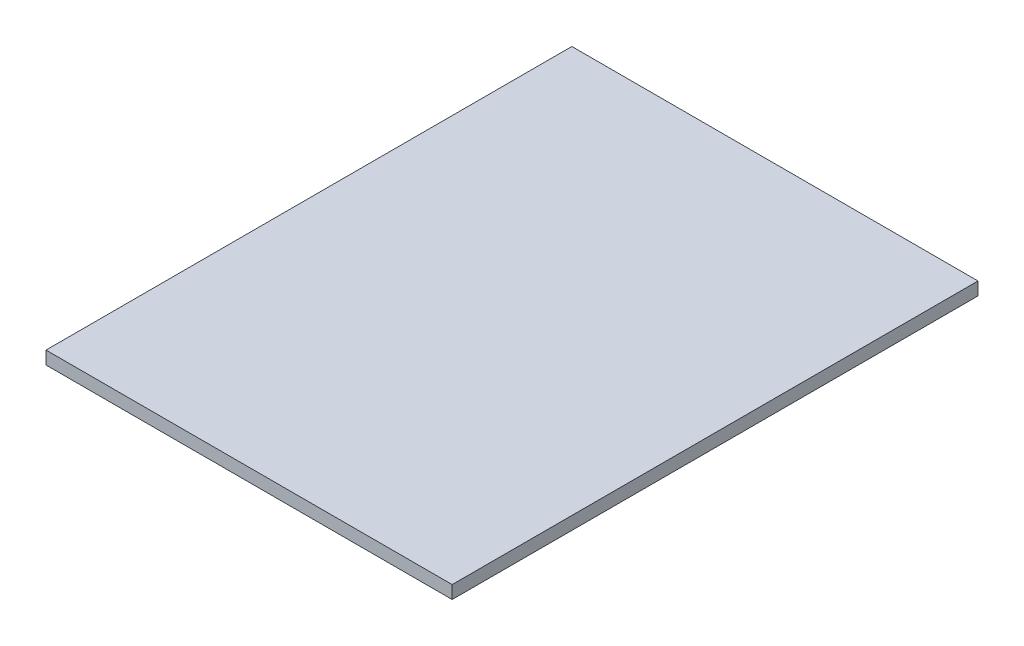
ISO-10303-21;
HEADER;
FILE_DESCRIPTION(('STEP AP214'),'2;1');
FILE_NAME('part.step','',(''),(''),'','','');
FILE_SCHEMA(('AUTOMOTIVE_DESIGN { 1 0 10303 214 1 1 1 1 }'));
ENDSEC;
DATA;
#1=APPLICATION_CONTEXT('core data for automotive mechanical design processes');
#2=APPLICATION_PROTOCOL_DEFINITION('international standard','automotive_design',2000,#1);
#3=PRODUCT_CONTEXT('',#1,'mechanical');
#4=PRODUCT('Part','Part','',(#3));
#5=PRODUCT_RELATED_PRODUCT_CATEGORY('part','',(#4));
#6=PRODUCT_DEFINITION_FORMATION('','',#4);
#7=PRODUCT_DEFINITION_CONTEXT('part definition',#1,'design');
#8=PRODUCT_DEFINITION('design','',#6,#7);
#9=PRODUCT_DEFINITION_SHAPE('','',#8);
#10=(LENGTH_UNIT() NAMED_UNIT(*) SI_UNIT(.MILLI.,.METRE.));
#11=(NAMED_UNIT(*) PLANE_ANGLE_UNIT() SI_UNIT($,.RADIAN.));
#12=(NAMED_UNIT(*) SI_UNIT($,.STERADIAN.) SOLID_ANGLE_UNIT());
#13=UNCERTAINTY_MEASURE_WITH_UNIT(LENGTH_MEASURE(1.E-05),#10,'distance_accuracy_value','');
#14=(GEOMETRIC_REPRESENTATION_CONTEXT(3) GLOBAL_UNCERTAINTY_ASSIGNED_CONTEXT((#13)) GLOBAL_UNIT_ASSIGNED_CONTEXT((#10,
#11,#12)) REPRESENTATION_CONTEXT('',''));
#15=CARTESIAN_POINT('',(0.,0.,0.));
#16=DIRECTION('',(0.,0.,1.));
#17=DIRECTION('',(1.,0.,0.));
#18=AXIS2_PLACEMENT_3D('',#15,#16,#17);
#19=CARTESIAN_POINT('',(0.,19.05,0.));
#20=DIRECTION('',(1.,0.,0.));
#21=DIRECTION('',(0.,0.,-1.));
#22=AXIS2_PLACEMENT_3D('',#19,#20,#21);
#23=PLANE('',#22);
#24=DIRECTION('',(0.,-1.,0.));
#25=VECTOR('',#24,1.);
#26=CARTESIAN_POINT('',(0.,19.05,-669.925));
#27=LINE('',#26,#25);
#28=CARTESIAN_POINT('',(0.,19.05,-669.925));
#29=VERTEX_POINT('',#28);
#30=CARTESIAN_POINT('',(0.,2.53999999999988,-669.925));
#31=VERTEX_POINT('',#30);
#32=EDGE_CURVE('E161',#29,#31,#27,.T.);
#33=ORIENTED_EDGE('',*,*,#32,.T.);
#34=DIRECTION('',(0.,0.,1.));
#35=VECTOR('',#34,1.);
#36=CARTESIAN_POINT('',(0.,2.53999999999988,0.));
#37=LINE('',#36,#35);
#38=CARTESIAN_POINT('',(0.,2.53999999999988,0.));
#39=VERTEX_POINT('',#38);
#40=EDGE_CURVE('E11',#31,#39,#37,.T.);
#41=ORIENTED_EDGE('',*,*,#40,.T.);
#42=DIRECTION('',(0.,-1.,0.));
#43=VECTOR('',#42,1.);
#44=CARTESIAN_POINT('',(0.,19.05,0.));
#45=LINE('',#44,#43);
#46=CARTESIAN_POINT('',(0.,19.05,0.));
#47=VERTEX_POINT('',#46);
#48=EDGE_CURVE('E103',#47,#39,#45,.T.);
#49=ORIENTED_EDGE('',*,*,#48,.F.);
#50=DIRECTION('',(0.,0.,1.));
#51=VECTOR('',#50,1.);
#52=CARTESIAN_POINT('',(0.,19.05,0.));
#53=LINE('',#52,#51);
#54=EDGE_CURVE('E109',#29,#47,#53,.T.);
#55=ORIENTED_EDGE('',*,*,#54,.F.);
#56=EDGE_LOOP('',(#33,#41,#49,#55));
#57=FACE_BOUND('',#56,.T.);
#58=ADVANCED_FACE('F41',(#57),#23,.F.);
#59=CARTESIAN_POINT('',(0.,19.05,0.));
#60=DIRECTION('',(0.,0.,-1.));
#61=DIRECTION('',(-1.,0.,0.));
#62=AXIS2_PLACEMENT_3D('',#59,#60,#61);
#63=PLANE('',#62);
#64=ORIENTED_EDGE('',*,*,#48,.T.);
#65=DIRECTION('',(1.,0.,0.));
#66=VECTOR('',#65,1.);
#67=CARTESIAN_POINT('',(517.4488,2.53999999999988,0.));
#68=LINE('',#67,#66);
#69=CARTESIAN_POINT('',(517.4488,2.53999999999988,0.));
#70=VERTEX_POINT('',#69);
#71=EDGE_CURVE('E118',#39,#70,#68,.T.);
#72=ORIENTED_EDGE('',*,*,#71,.T.);
#73=DIRECTION('',(0.,-1.,0.));
#74=VECTOR('',#73,1.);
#75=CARTESIAN_POINT('',(517.4488,19.05,0.));
#76=LINE('',#75,#74);
#77=CARTESIAN_POINT('',(517.4488,19.05,0.));
#78=VERTEX_POINT('',#77);
#79=EDGE_CURVE('E105',#78,#70,#76,.T.);
#80=ORIENTED_EDGE('',*,*,#79,.F.);
#81=DIRECTION('',(1.,0.,0.));
#82=VECTOR('',#81,1.);
#83=CARTESIAN_POINT('',(0.,19.05,0.));
#84=LINE('',#83,#82);
#85=EDGE_CURVE('E98',#47,#78,#84,.T.);
#86=ORIENTED_EDGE('',*,*,#85,.F.);
#87=EDGE_LOOP('',(#64,#72,#80,#86));
#88=FACE_BOUND('',#87,.T.);
#89=ADVANCED_FACE('F100',(#88),#63,.F.);
#90=CARTESIAN_POINT('',(517.4488,19.05,0.));
#91=DIRECTION('',(-1.,0.,0.));
#92=DIRECTION('',(0.,0.,1.));
#93=AXIS2_PLACEMENT_3D('',#90,#91,#92);
#94=PLANE('',#93);
#95=ORIENTED_EDGE('',*,*,#79,.T.);
#96=DIRECTION('',(0.,0.,-1.));
#97=VECTOR('',#96,1.);
#98=CARTESIAN_POINT('',(517.4488,2.53999999999988,-669.925));
#99=LINE('',#98,#97);
#100=CARTESIAN_POINT('',(517.4488,2.53999999999988,-669.925));
#101=VERTEX_POINT('',#100);
#102=EDGE_CURVE('E66',#70,#101,#99,.T.);
#103=ORIENTED_EDGE('',*,*,#102,.T.);
#104=DIRECTION('',(0.,-1.,0.));
#105=VECTOR('',#104,1.);
#106=CARTESIAN_POINT('',(517.4488,19.05,-669.925));
#107=LINE('',#106,#105);
#108=CARTESIAN_POINT('',(517.4488,19.05,-669.925));
#109=VERTEX_POINT('',#108);
#110=EDGE_CURVE('E122',#109,#101,#107,.T.);
#111=ORIENTED_EDGE('',*,*,#110,.F.);
#112=DIRECTION('',(0.,0.,-1.));
#113=VECTOR('',#112,1.);
#114=CARTESIAN_POINT('',(517.4488,19.05,0.));
#115=LINE('',#114,#113);
#116=EDGE_CURVE('E108',#78,#109,#115,.T.);
#117=ORIENTED_EDGE('',*,*,#116,.F.);
#118=EDGE_LOOP('',(#95,#103,#111,#117));
#119=FACE_BOUND('',#118,.T.);
#120=ADVANCED_FACE('F159',(#119),#94,.F.);
#121=CARTESIAN_POINT('',(0.,19.05,-669.925));
#122=DIRECTION('',(0.,0.,1.));
#123=DIRECTION('',(1.,0.,0.));
#124=AXIS2_PLACEMENT_3D('',#121,#122,#123);
#125=PLANE('',#124);
#126=ORIENTED_EDGE('',*,*,#110,.T.);
#127=DIRECTION('',(-1.,0.,0.));
#128=VECTOR('',#127,1.);
#129=CARTESIAN_POINT('',(0.,2.53999999999988,-669.925));
#130=LINE('',#129,#128);
#131=EDGE_CURVE('E51',#101,#31,#130,.T.);
#132=ORIENTED_EDGE('',*,*,#131,.T.);
#133=ORIENTED_EDGE('',*,*,#32,.F.);
#134=DIRECTION('',(-1.,0.,0.));
#135=VECTOR('',#134,1.);
#136=CARTESIAN_POINT('',(0.,19.05,-669.925));
#137=LINE('',#136,#135);
#138=EDGE_CURVE('E114',#109,#29,#137,.T.);
#139=ORIENTED_EDGE('',*,*,#138,.F.);
#140=EDGE_LOOP('',(#126,#132,#133,#139));
#141=FACE_BOUND('',#140,.T.);
#142=ADVANCED_FACE('F164',(#141),#125,.F.);
#143=CARTESIAN_POINT('',(0.,19.05,0.));
#144=DIRECTION('',(0.,-1.,0.));
#145=DIRECTION('',(0.,0.,-1.));
#146=AXIS2_PLACEMENT_3D('',#143,#144,#145);
#147=PLANE('',#146);
#148=ORIENTED_EDGE('',*,*,#54,.T.);
#149=ORIENTED_EDGE('',*,*,#85,.T.);
#150=ORIENTED_EDGE('',*,*,#116,.T.);
#151=ORIENTED_EDGE('',*,*,#138,.T.);
#152=EDGE_LOOP('',(#148,#149,#150,#151));
#153=FACE_BOUND('',#152,.T.);
#154=ADVANCED_FACE('F112',(#153),#147,.F.);
#155=CARTESIAN_POINT('',(0.,0.,0.));
#156=DIRECTION('',(0.,-1.,0.));
#157=DIRECTION('',(0.,0.,-1.));
#158=AXIS2_PLACEMENT_3D('',#155,#156,#157);
#159=PLANE('',#158);
#160=DIRECTION('',(0.,0.,1.));
#161=VECTOR('',#160,1.);
#162=CARTESIAN_POINT('',(514.9088,0.,0.));
#163=LINE('',#162,#161);
#164=CARTESIAN_POINT('',(514.9088,0.,-667.385));
#165=VERTEX_POINT('',#164);
#166=CARTESIAN_POINT('',(514.9088,0.,-2.53999999999987));
#167=VERTEX_POINT('',#166);
#168=EDGE_CURVE('E129',#165,#167,#163,.T.);
#169=ORIENTED_EDGE('',*,*,#168,.T.);
#170=DIRECTION('',(-1.,0.,0.));
#171=VECTOR('',#170,1.);
#172=CARTESIAN_POINT('',(0.,0.,-2.53999999999987));
#173=LINE('',#172,#171);
#174=CARTESIAN_POINT('',(2.53999999999987,0.,-2.53999999999987));
#175=VERTEX_POINT('',#174);
#176=EDGE_CURVE('E131',#167,#175,#173,.T.);
#177=ORIENTED_EDGE('',*,*,#176,.T.);
#178=DIRECTION('',(0.,0.,-1.));
#179=VECTOR('',#178,1.);
#180=CARTESIAN_POINT('',(2.53999999999987,0.,-669.925));
#181=LINE('',#180,#179);
#182=CARTESIAN_POINT('',(2.53999999999987,0.,-667.385));
#183=VERTEX_POINT('',#182);
#184=EDGE_CURVE('E120',#175,#183,#181,.T.);
#185=ORIENTED_EDGE('',*,*,#184,.T.);
#186=DIRECTION('',(1.,0.,0.));
#187=VECTOR('',#186,1.);
#188=CARTESIAN_POINT('',(517.4488,0.,-667.385));
#189=LINE('',#188,#187);
#190=EDGE_CURVE('E127',#183,#165,#189,.T.);
#191=ORIENTED_EDGE('',*,*,#190,.T.);
#192=EDGE_LOOP('',(#169,#177,#185,#191));
#193=FACE_BOUND('',#192,.T.);
#194=ADVANCED_FACE('F152',(#193),#159,.T.);
#195=CARTESIAN_POINT('',(0.,2.53999999999988,-669.925));
#196=DIRECTION('',(0.,-0.707106781186548,-0.707106781186548));
#197=DIRECTION('',(1.,0.,0.));
#198=AXIS2_PLACEMENT_3D('',#195,#196,#197);
#199=PLANE('',#198);
#200=DIRECTION('',(-0.577350269189626,-0.577350269189626,0.577350269189626));
#201=VECTOR('',#200,1.);
#202=CARTESIAN_POINT('',(344.965866666667,-169.942933333333,-497.442066666667));
#203=LINE('',#202,#201);
#204=EDGE_CURVE('E139',#165,#101,#203,.F.);
#205=ORIENTED_EDGE('',*,*,#204,.F.);
#206=ORIENTED_EDGE('',*,*,#190,.F.);
#207=DIRECTION('',(0.577350269189626,-0.577350269189626,0.577350269189626));
#208=VECTOR('',#207,1.);
#209=CARTESIAN_POINT('',(223.308333333333,-220.768333333334,-446.616666666667));
#210=LINE('',#209,#208);
#211=EDGE_CURVE('E46',#31,#183,#210,.T.);
#212=ORIENTED_EDGE('',*,*,#211,.F.);
#213=ORIENTED_EDGE('',*,*,#131,.F.);
#214=EDGE_LOOP('',(#205,#206,#212,#213));
#215=FACE_BOUND('',#214,.T.);
#216=ADVANCED_FACE('F44',(#215),#199,.T.);
#217=CARTESIAN_POINT('',(0.,2.53999999999988,0.));
#218=DIRECTION('',(-0.707106781186548,-0.707106781186547,0.));
#219=DIRECTION('',(0.,0.,-1.));
#220=AXIS2_PLACEMENT_3D('',#217,#218,#219);
#221=PLANE('',#220);
#222=ORIENTED_EDGE('',*,*,#211,.T.);
#223=ORIENTED_EDGE('',*,*,#184,.F.);
#224=DIRECTION('',(-0.577350269189626,0.577350269189626,0.577350269189626));
#225=VECTOR('',#224,1.);
#226=CARTESIAN_POINT('',(0.,2.53999999999988,0.));
#227=LINE('',#226,#225);
#228=EDGE_CURVE('E138',#39,#175,#227,.F.);
#229=ORIENTED_EDGE('',*,*,#228,.F.);
#230=ORIENTED_EDGE('',*,*,#40,.F.);
#231=EDGE_LOOP('',(#222,#223,#229,#230));
#232=FACE_BOUND('',#231,.T.);
#233=ADVANCED_FACE('F148',(#232),#221,.T.);
#234=CARTESIAN_POINT('',(517.4488,2.53999999999988,0.));
#235=DIRECTION('',(0.707106781186548,-0.707106781186548,0.));
#236=DIRECTION('',(0.,0.,1.));
#237=AXIS2_PLACEMENT_3D('',#234,#235,#236);
#238=PLANE('',#237);
#239=ORIENTED_EDGE('',*,*,#204,.T.);
#240=ORIENTED_EDGE('',*,*,#102,.F.);
#241=DIRECTION('',(-0.577350269189626,-0.577350269189626,-0.577350269189626));
#242=VECTOR('',#241,1.);
#243=CARTESIAN_POINT('',(517.4488,2.53999999999988,0.));
#244=LINE('',#243,#242);
#245=EDGE_CURVE('E136',#167,#70,#244,.F.);
#246=ORIENTED_EDGE('',*,*,#245,.F.);
#247=ORIENTED_EDGE('',*,*,#168,.F.);
#248=EDGE_LOOP('',(#239,#240,#246,#247));
#249=FACE_BOUND('',#248,.T.);
#250=ADVANCED_FACE('F158',(#249),#238,.T.);
#251=CARTESIAN_POINT('',(0.,2.53999999999988,0.));
#252=DIRECTION('',(0.,-0.707106781186547,0.707106781186548));
#253=DIRECTION('',(-1.,0.,0.));
#254=AXIS2_PLACEMENT_3D('',#251,#252,#253);
#255=PLANE('',#254);
#256=ORIENTED_EDGE('',*,*,#228,.T.);
#257=ORIENTED_EDGE('',*,*,#176,.F.);
#258=ORIENTED_EDGE('',*,*,#245,.T.);
#259=ORIENTED_EDGE('',*,*,#71,.F.);
#260=EDGE_LOOP('',(#256,#257,#258,#259));
#261=FACE_BOUND('',#260,.T.);
#262=ADVANCED_FACE('F156',(#261),#255,.T.);
#263=CLOSED_SHELL('',(#58,#89,#120,#142,#154,#194,#216,#233,#250,#262));
#264=MANIFOLD_SOLID_BREP('B2',#263);
#265=ADVANCED_BREP_SHAPE_REPRESENTATION('',(#18,#264),#14);
#266=SHAPE_DEFINITION_REPRESENTATION(#9,#265);
ENDSEC;
END-ISO-10303-21;
